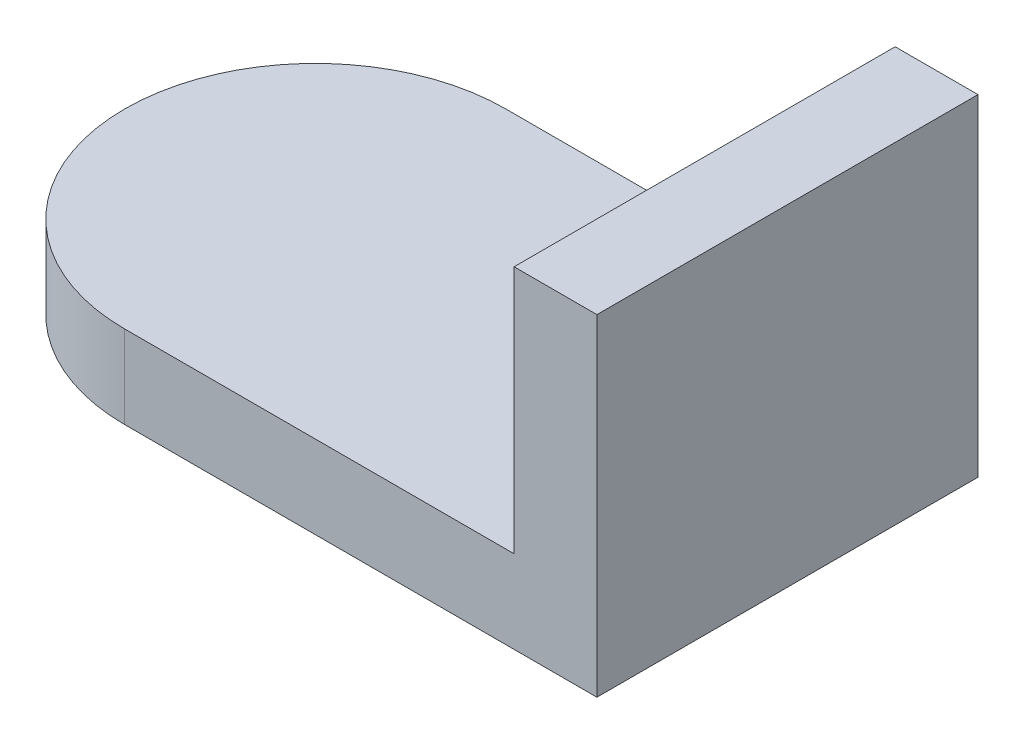
ISO-10303-21;
HEADER;
FILE_DESCRIPTION(('STEP AP214'),'2;1');
FILE_NAME('part.step','',(''),(''),'','','');
FILE_SCHEMA(('AUTOMOTIVE_DESIGN { 1 0 10303 214 1 1 1 1 }'));
ENDSEC;
DATA;
#1=APPLICATION_CONTEXT('core data for automotive mechanical design processes');
#2=APPLICATION_PROTOCOL_DEFINITION('international standard','automotive_design',2000,#1);
#3=PRODUCT_CONTEXT('',#1,'mechanical');
#4=PRODUCT('Part','Part','',(#3));
#5=PRODUCT_RELATED_PRODUCT_CATEGORY('part','',(#4));
#6=PRODUCT_DEFINITION_FORMATION('','',#4);
#7=PRODUCT_DEFINITION_CONTEXT('part definition',#1,'design');
#8=PRODUCT_DEFINITION('design','',#6,#7);
#9=PRODUCT_DEFINITION_SHAPE('','',#8);
#10=(LENGTH_UNIT() NAMED_UNIT(*) SI_UNIT(.MILLI.,.METRE.));
#11=(NAMED_UNIT(*) PLANE_ANGLE_UNIT() SI_UNIT($,.RADIAN.));
#12=(NAMED_UNIT(*) SI_UNIT($,.STERADIAN.) SOLID_ANGLE_UNIT());
#13=UNCERTAINTY_MEASURE_WITH_UNIT(LENGTH_MEASURE(1.E-05),#10,'distance_accuracy_value','');
#14=(GEOMETRIC_REPRESENTATION_CONTEXT(3) GLOBAL_UNCERTAINTY_ASSIGNED_CONTEXT((#13)) GLOBAL_UNIT_ASSIGNED_CONTEXT((#10,
#11,#12)) REPRESENTATION_CONTEXT('',''));
#15=CARTESIAN_POINT('',(0.,0.,0.));
#16=DIRECTION('',(0.,0.,1.));
#17=DIRECTION('',(1.,0.,0.));
#18=AXIS2_PLACEMENT_3D('',#15,#16,#17);
#19=CARTESIAN_POINT('',(1.45,-0.2,-0.864999999999999));
#20=DIRECTION('',(0.,0.,-1.));
#21=DIRECTION('',(1.,0.,0.));
#22=AXIS2_PLACEMENT_3D('',#19,#20,#21);
#23=PLANE('',#22);
#24=DIRECTION('',(0.,-1.,0.));
#25=VECTOR('',#24,1.);
#26=CARTESIAN_POINT('',(1.5,-0.2,-0.864999999999999));
#27=LINE('',#26,#25);
#28=CARTESIAN_POINT('',(1.5,-0.2,-0.864999999999999));
#29=VERTEX_POINT('',#28);
#30=CARTESIAN_POINT('',(1.5,-0.4,-0.864999999999999));
#31=VERTEX_POINT('',#30);
#32=EDGE_CURVE('E11',#29,#31,#27,.T.);
#33=ORIENTED_EDGE('',*,*,#32,.T.);
#34=DIRECTION('',(1.,0.,0.));
#35=VECTOR('',#34,1.);
#36=CARTESIAN_POINT('',(1.45,-0.4,-0.864999999999999));
#37=LINE('',#36,#35);
#38=CARTESIAN_POINT('',(1.215,-0.4,-0.864999999999999));
#39=VERTEX_POINT('',#38);
#40=EDGE_CURVE('E24',#39,#31,#37,.T.);
#41=ORIENTED_EDGE('',*,*,#40,.F.);
#42=DIRECTION('',(0.,-1.,0.));
#43=VECTOR('',#42,1.);
#44=CARTESIAN_POINT('',(1.215,-0.35,-0.864999999999999));
#45=LINE('',#44,#43);
#46=CARTESIAN_POINT('',(1.215,-0.35,-0.864999999999999));
#47=VERTEX_POINT('',#46);
#48=EDGE_CURVE('E86',#47,#39,#45,.T.);
#49=ORIENTED_EDGE('',*,*,#48,.F.);
#50=DIRECTION('',(-1.,0.,0.));
#51=VECTOR('',#50,1.);
#52=CARTESIAN_POINT('',(1.45,-0.35,-0.864999999999999));
#53=LINE('',#52,#51);
#54=CARTESIAN_POINT('',(1.45,-0.35,-0.864999999999999));
#55=VERTEX_POINT('',#54);
#56=EDGE_CURVE('E115',#55,#47,#53,.T.);
#57=ORIENTED_EDGE('',*,*,#56,.F.);
#58=DIRECTION('',(0.,-1.,0.));
#59=VECTOR('',#58,1.);
#60=CARTESIAN_POINT('',(1.45,-0.2,-0.864999999999999));
#61=LINE('',#60,#59);
#62=CARTESIAN_POINT('',(1.45,-0.2,-0.864999999999999));
#63=VERTEX_POINT('',#62);
#64=EDGE_CURVE('E112',#63,#55,#61,.T.);
#65=ORIENTED_EDGE('',*,*,#64,.F.);
#66=DIRECTION('',(1.,0.,0.));
#67=VECTOR('',#66,1.);
#68=CARTESIAN_POINT('',(1.45,-0.2,-0.864999999999999));
#69=LINE('',#68,#67);
#70=EDGE_CURVE('E110',#63,#29,#69,.T.);
#71=ORIENTED_EDGE('',*,*,#70,.T.);
#72=EDGE_LOOP('',(#33,#41,#49,#57,#65,#71));
#73=FACE_BOUND('',#72,.T.);
#74=ADVANCED_FACE('F17',(#73),#23,.T.);
#75=CARTESIAN_POINT('',(1.45,-0.2,-0.864999999999999));
#76=DIRECTION('',(0.,1.,0.));
#77=DIRECTION('',(0.,0.,1.));
#78=AXIS2_PLACEMENT_3D('',#75,#76,#77);
#79=PLANE('',#78);
#80=DIRECTION('',(0.,0.,-1.));
#81=VECTOR('',#80,1.);
#82=CARTESIAN_POINT('',(1.5,-0.2,-0.864999999999999));
#83=LINE('',#82,#81);
#84=CARTESIAN_POINT('',(1.5,-0.2,-0.635));
#85=VERTEX_POINT('',#84);
#86=EDGE_CURVE('E107',#85,#29,#83,.T.);
#87=ORIENTED_EDGE('',*,*,#86,.T.);
#88=ORIENTED_EDGE('',*,*,#70,.F.);
#89=DIRECTION('',(0.,0.,-1.));
#90=VECTOR('',#89,1.);
#91=CARTESIAN_POINT('',(1.45,-0.2,-0.864999999999999));
#92=LINE('',#91,#90);
#93=CARTESIAN_POINT('',(1.45,-0.2,-0.635));
#94=VERTEX_POINT('',#93);
#95=EDGE_CURVE('E104',#94,#63,#92,.T.);
#96=ORIENTED_EDGE('',*,*,#95,.F.);
#97=DIRECTION('',(1.,0.,0.));
#98=VECTOR('',#97,1.);
#99=CARTESIAN_POINT('',(1.45,-0.2,-0.635));
#100=LINE('',#99,#98);
#101=EDGE_CURVE('E101',#94,#85,#100,.T.);
#102=ORIENTED_EDGE('',*,*,#101,.T.);
#103=EDGE_LOOP('',(#87,#88,#96,#102));
#104=FACE_BOUND('',#103,.T.);
#105=ADVANCED_FACE('F127',(#104),#79,.T.);
#106=CARTESIAN_POINT('',(1.45,-0.2,-0.635));
#107=DIRECTION('',(0.,0.,1.));
#108=DIRECTION('',(0.,-1.,0.));
#109=AXIS2_PLACEMENT_3D('',#106,#107,#108);
#110=PLANE('',#109);
#111=DIRECTION('',(0.,1.,0.));
#112=VECTOR('',#111,1.);
#113=CARTESIAN_POINT('',(1.5,-0.2,-0.635));
#114=LINE('',#113,#112);
#115=CARTESIAN_POINT('',(1.5,-0.4,-0.635));
#116=VERTEX_POINT('',#115);
#117=EDGE_CURVE('E99',#116,#85,#114,.T.);
#118=ORIENTED_EDGE('',*,*,#117,.T.);
#119=ORIENTED_EDGE('',*,*,#101,.F.);
#120=DIRECTION('',(0.,1.,0.));
#121=VECTOR('',#120,1.);
#122=CARTESIAN_POINT('',(1.45,-0.2,-0.635));
#123=LINE('',#122,#121);
#124=CARTESIAN_POINT('',(1.45,-0.35,-0.635));
#125=VERTEX_POINT('',#124);
#126=EDGE_CURVE('E96',#125,#94,#123,.T.);
#127=ORIENTED_EDGE('',*,*,#126,.F.);
#128=DIRECTION('',(1.,0.,0.));
#129=VECTOR('',#128,1.);
#130=CARTESIAN_POINT('',(1.45,-0.35,-0.635));
#131=LINE('',#130,#129);
#132=CARTESIAN_POINT('',(1.215,-0.35,-0.635));
#133=VERTEX_POINT('',#132);
#134=EDGE_CURVE('E72',#133,#125,#131,.T.);
#135=ORIENTED_EDGE('',*,*,#134,.F.);
#136=DIRECTION('',(0.,-1.,0.));
#137=VECTOR('',#136,1.);
#138=CARTESIAN_POINT('',(1.215,-0.35,-0.635));
#139=LINE('',#138,#137);
#140=CARTESIAN_POINT('',(1.215,-0.4,-0.635));
#141=VERTEX_POINT('',#140);
#142=EDGE_CURVE('E65',#133,#141,#139,.T.);
#143=ORIENTED_EDGE('',*,*,#142,.T.);
#144=DIRECTION('',(1.,0.,0.));
#145=VECTOR('',#144,1.);
#146=CARTESIAN_POINT('',(1.45,-0.4,-0.635));
#147=LINE('',#146,#145);
#148=EDGE_CURVE('E69',#141,#116,#147,.T.);
#149=ORIENTED_EDGE('',*,*,#148,.T.);
#150=EDGE_LOOP('',(#118,#119,#127,#135,#143,#149));
#151=FACE_BOUND('',#150,.T.);
#152=ADVANCED_FACE('F68',(#151),#110,.T.);
#153=CARTESIAN_POINT('',(1.45,-0.4,-0.864999999999999));
#154=DIRECTION('',(0.,-1.,0.));
#155=DIRECTION('',(0.,0.,-1.));
#156=AXIS2_PLACEMENT_3D('',#153,#154,#155);
#157=PLANE('',#156);
#158=DIRECTION('',(0.,0.,1.));
#159=VECTOR('',#158,1.);
#160=CARTESIAN_POINT('',(1.5,-0.4,-0.864999999999999));
#161=LINE('',#160,#159);
#162=EDGE_CURVE('E82',#31,#116,#161,.T.);
#163=ORIENTED_EDGE('',*,*,#162,.T.);
#164=ORIENTED_EDGE('',*,*,#148,.F.);
#165=CARTESIAN_POINT('',(1.215,-0.4,-0.749999999999999));
#166=DIRECTION('',(0.,1.,0.));
#167=DIRECTION('',(0.,0.,1.));
#168=AXIS2_PLACEMENT_3D('',#165,#166,#167);
#169=CIRCLE('',#168,0.115);
#170=EDGE_CURVE('E81',#39,#141,#169,.T.);
#171=ORIENTED_EDGE('',*,*,#170,.F.);
#172=ORIENTED_EDGE('',*,*,#40,.T.);
#173=EDGE_LOOP('',(#163,#164,#171,#172));
#174=FACE_BOUND('',#173,.T.);
#175=ADVANCED_FACE('F80',(#174),#157,.T.);
#176=CARTESIAN_POINT('',(1.45,0.,0.));
#177=DIRECTION('',(1.,0.,0.));
#178=DIRECTION('',(0.,0.,1.));
#179=AXIS2_PLACEMENT_3D('',#176,#177,#178);
#180=PLANE('',#179);
#181=ORIENTED_EDGE('',*,*,#126,.T.);
#182=ORIENTED_EDGE('',*,*,#95,.T.);
#183=ORIENTED_EDGE('',*,*,#64,.T.);
#184=DIRECTION('',(0.,0.,-1.));
#185=VECTOR('',#184,1.);
#186=CARTESIAN_POINT('',(1.45,-0.35,-0.864999999999999));
#187=LINE('',#186,#185);
#188=EDGE_CURVE('E87',#125,#55,#187,.T.);
#189=ORIENTED_EDGE('',*,*,#188,.F.);
#190=EDGE_LOOP('',(#181,#182,#183,#189));
#191=FACE_BOUND('',#190,.T.);
#192=ADVANCED_FACE('F123',(#191),#180,.F.);
#193=CARTESIAN_POINT('',(1.5,0.,0.));
#194=DIRECTION('',(1.,0.,0.));
#195=DIRECTION('',(0.,0.,1.));
#196=AXIS2_PLACEMENT_3D('',#193,#194,#195);
#197=PLANE('',#196);
#198=ORIENTED_EDGE('',*,*,#32,.F.);
#199=ORIENTED_EDGE('',*,*,#86,.F.);
#200=ORIENTED_EDGE('',*,*,#117,.F.);
#201=ORIENTED_EDGE('',*,*,#162,.F.);
#202=EDGE_LOOP('',(#198,#199,#200,#201));
#203=FACE_BOUND('',#202,.T.);
#204=ADVANCED_FACE('F118',(#203),#197,.T.);
#205=CARTESIAN_POINT('',(1.215,-0.35,-0.749999999999999));
#206=DIRECTION('',(0.,-1.,0.));
#207=DIRECTION('',(0.,0.,-1.));
#208=AXIS2_PLACEMENT_3D('',#205,#206,#207);
#209=CYLINDRICAL_SURFACE('',#208,0.115);
#210=ORIENTED_EDGE('',*,*,#170,.T.);
#211=ORIENTED_EDGE('',*,*,#142,.F.);
#212=CARTESIAN_POINT('',(1.215,-0.35,-0.749999999999999));
#213=DIRECTION('',(0.,1.,0.));
#214=DIRECTION('',(0.,0.,1.));
#215=AXIS2_PLACEMENT_3D('',#212,#213,#214);
#216=CIRCLE('',#215,0.115);
#217=EDGE_CURVE('E91',#47,#133,#216,.T.);
#218=ORIENTED_EDGE('',*,*,#217,.F.);
#219=ORIENTED_EDGE('',*,*,#48,.T.);
#220=EDGE_LOOP('',(#210,#211,#218,#219));
#221=FACE_BOUND('',#220,.T.);
#222=ADVANCED_FACE('F85',(#221),#209,.T.);
#223=CARTESIAN_POINT('',(1.215,-0.35,-0.749999999999999));
#224=DIRECTION('',(0.,1.,0.));
#225=DIRECTION('',(0.,0.,1.));
#226=AXIS2_PLACEMENT_3D('',#223,#224,#225);
#227=PLANE('',#226);
#228=ORIENTED_EDGE('',*,*,#188,.T.);
#229=ORIENTED_EDGE('',*,*,#56,.T.);
#230=ORIENTED_EDGE('',*,*,#217,.T.);
#231=ORIENTED_EDGE('',*,*,#134,.T.);
#232=EDGE_LOOP('',(#228,#229,#230,#231));
#233=FACE_BOUND('',#232,.T.);
#234=ADVANCED_FACE('F125',(#233),#227,.T.);
#235=CLOSED_SHELL('',(#74,#105,#152,#175,#192,#204,#222,#234));
#236=MANIFOLD_SOLID_BREP('B1',#235);
#237=ADVANCED_BREP_SHAPE_REPRESENTATION('',(#18,#236),#14);
#238=SHAPE_DEFINITION_REPRESENTATION(#9,#237);
ENDSEC;
END-ISO-10303-21;
